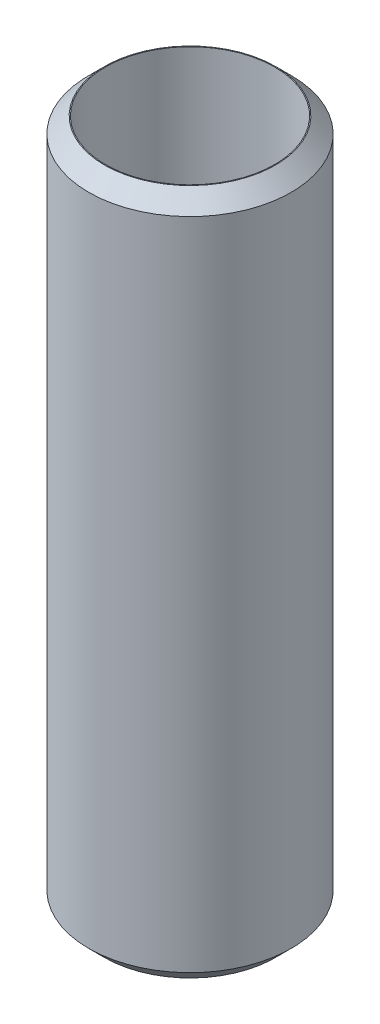
ISO-10303-21;
HEADER;
FILE_DESCRIPTION(('STEP AP214'),'2;1');
FILE_NAME('part.step','',(''),(''),'','','');
FILE_SCHEMA(('AUTOMOTIVE_DESIGN { 1 0 10303 214 1 1 1 1 }'));
ENDSEC;
DATA;
#1=APPLICATION_CONTEXT('core data for automotive mechanical design processes');
#2=APPLICATION_PROTOCOL_DEFINITION('international standard','automotive_design',2000,#1);
#3=PRODUCT_CONTEXT('',#1,'mechanical');
#4=PRODUCT('Part','Part','',(#3));
#5=PRODUCT_RELATED_PRODUCT_CATEGORY('part','',(#4));
#6=PRODUCT_DEFINITION_FORMATION('','',#4);
#7=PRODUCT_DEFINITION_CONTEXT('part definition',#1,'design');
#8=PRODUCT_DEFINITION('design','',#6,#7);
#9=PRODUCT_DEFINITION_SHAPE('','',#8);
#10=(LENGTH_UNIT() NAMED_UNIT(*) SI_UNIT(.MILLI.,.METRE.));
#11=(NAMED_UNIT(*) PLANE_ANGLE_UNIT() SI_UNIT($,.RADIAN.));
#12=(NAMED_UNIT(*) SI_UNIT($,.STERADIAN.) SOLID_ANGLE_UNIT());
#13=UNCERTAINTY_MEASURE_WITH_UNIT(LENGTH_MEASURE(1.E-05),#10,'distance_accuracy_value','');
#14=(GEOMETRIC_REPRESENTATION_CONTEXT(3) GLOBAL_UNCERTAINTY_ASSIGNED_CONTEXT((#13)) GLOBAL_UNIT_ASSIGNED_CONTEXT((#10,
#11,#12)) REPRESENTATION_CONTEXT('',''));
#15=CARTESIAN_POINT('',(0.,0.,0.));
#16=DIRECTION('',(0.,0.,1.));
#17=DIRECTION('',(1.,0.,0.));
#18=AXIS2_PLACEMENT_3D('',#15,#16,#17);
#19=CARTESIAN_POINT('',(0.,237.281671656271,0.));
#20=DIRECTION('',(0.,-1.,0.));
#21=DIRECTION('',(0.,0.,-1.));
#22=AXIS2_PLACEMENT_3D('',#19,#20,#21);
#23=CYLINDRICAL_SURFACE('',#22,35.);
#24=CARTESIAN_POINT('',(0.,231.837477696698,0.));
#25=DIRECTION('',(0.,1.,0.));
#26=DIRECTION('',(0.,0.,1.));
#27=AXIS2_PLACEMENT_3D('',#24,#25,#26);
#28=CIRCLE('',#27,35.);
#29=CARTESIAN_POINT('',(0.,231.837477696698,-35.));
#30=VERTEX_POINT('',#29);
#31=EDGE_CURVE('E50',#30,#30,#28,.F.);
#32=CARTESIAN_POINT('',(0.,5.44419395957246,0.));
#33=DIRECTION('',(0.,1.,0.));
#34=DIRECTION('',(0.,0.,1.));
#35=AXIS2_PLACEMENT_3D('',#32,#33,#34);
#36=CIRCLE('',#35,35.);
#37=CARTESIAN_POINT('',(0.,5.44419395957244,-35.));
#38=VERTEX_POINT('',#37);
#39=EDGE_CURVE('E51',#38,#38,#36,.T.);
#40=CARTESIAN_POINT('',(0.,231.837477696698,-35.));
#41=CARTESIAN_POINT('',(0.,229.479214324437,-35.));
#42=CARTESIAN_POINT('',(0.,227.120950952175,-35.));
#43=CARTESIAN_POINT('',(0.,222.404424207651,-35.));
#44=CARTESIAN_POINT('',(0.,220.04616083539,-35.));
#45=CARTESIAN_POINT('',(0.,215.329634090866,-35.));
#46=CARTESIAN_POINT('',(0.,212.971370718605,-35.));
#47=CARTESIAN_POINT('',(0.,208.254843974081,-35.));
#48=CARTESIAN_POINT('',(0.,205.896580601819,-35.));
#49=CARTESIAN_POINT('',(0.,201.180053857296,-35.));
#50=CARTESIAN_POINT('',(0.,198.821790485034,-35.));
#51=CARTESIAN_POINT('',(0.,194.105263740511,-35.));
#52=CARTESIAN_POINT('',(0.,191.747000368249,-35.));
#53=CARTESIAN_POINT('',(0.,187.030473623726,-35.));
#54=CARTESIAN_POINT('',(0.,184.672210251464,-35.));
#55=CARTESIAN_POINT('',(0.,179.95568350694,-35.));
#56=CARTESIAN_POINT('',(0.,177.597420134679,-35.));
#57=CARTESIAN_POINT('',(0.,172.880893390155,-35.));
#58=CARTESIAN_POINT('',(0.,170.522630017893,-35.));
#59=CARTESIAN_POINT('',(0.,165.80610327337,-35.));
#60=CARTESIAN_POINT('',(0.,163.447839901108,-35.));
#61=CARTESIAN_POINT('',(0.,158.731313156585,-35.));
#62=CARTESIAN_POINT('',(0.,156.373049784323,-35.));
#63=CARTESIAN_POINT('',(0.,151.6565230398,-35.));
#64=CARTESIAN_POINT('',(0.,149.298259667538,-35.));
#65=CARTESIAN_POINT('',(0.,144.581732923014,-35.));
#66=CARTESIAN_POINT('',(0.,142.223469550753,-35.));
#67=CARTESIAN_POINT('',(0.,137.506942806229,-35.));
#68=CARTESIAN_POINT('',(0.,135.148679433968,-35.));
#69=CARTESIAN_POINT('',(0.,130.432152689444,-35.));
#70=CARTESIAN_POINT('',(0.,128.073889317182,-35.));
#71=CARTESIAN_POINT('',(0.,123.357362572659,-35.));
#72=CARTESIAN_POINT('',(0.,120.999099200397,-35.));
#73=CARTESIAN_POINT('',(0.,116.282572455874,-35.));
#74=CARTESIAN_POINT('',(0.,113.924309083612,-35.));
#75=CARTESIAN_POINT('',(0.,109.207782339088,-35.));
#76=CARTESIAN_POINT('',(0.,106.849518966827,-35.));
#77=CARTESIAN_POINT('',(0.,102.132992222303,-35.));
#78=CARTESIAN_POINT('',(0.,99.7747288500416,-35.));
#79=CARTESIAN_POINT('',(0.,95.0582021055181,-35.));
#80=CARTESIAN_POINT('',(0.,92.6999387332564,-35.));
#81=CARTESIAN_POINT('',(0.,87.983411988733,-35.));
#82=CARTESIAN_POINT('',(0.,85.6251486164712,-35.));
#83=CARTESIAN_POINT('',(0.,80.9086218719478,-35.));
#84=CARTESIAN_POINT('',(0.,78.5503584996861,-35.));
#85=CARTESIAN_POINT('',(0.,73.8338317551626,-35.));
#86=CARTESIAN_POINT('',(0.,71.4755683829009,-35.));
#87=CARTESIAN_POINT('',(0.,66.7590416383774,-35.));
#88=CARTESIAN_POINT('',(0.,64.4007782661157,-35.));
#89=CARTESIAN_POINT('',(0.,59.6842515215922,-35.));
#90=CARTESIAN_POINT('',(0.,57.3259881493305,-35.));
#91=CARTESIAN_POINT('',(0.,52.609461404807,-35.));
#92=CARTESIAN_POINT('',(0.,50.2511980325453,-35.));
#93=CARTESIAN_POINT('',(0.,45.5346712880218,-35.));
#94=CARTESIAN_POINT('',(0.,43.1764079157601,-35.));
#95=CARTESIAN_POINT('',(0.,38.4598811712367,-35.));
#96=CARTESIAN_POINT('',(0.,36.1016177989749,-35.));
#97=CARTESIAN_POINT('',(0.,31.3850910544515,-35.));
#98=CARTESIAN_POINT('',(0.,29.0268276821897,-35.));
#99=CARTESIAN_POINT('',(0.,24.3103009376663,-35.));
#100=CARTESIAN_POINT('',(0.,21.9520375654045,-35.));
#101=CARTESIAN_POINT('',(0.,17.2355108208811,-35.));
#102=CARTESIAN_POINT('',(0.,14.8772474486194,-35.));
#103=CARTESIAN_POINT('',(0.,10.1607207040959,-35.));
#104=CARTESIAN_POINT('',(0.,7.80245733183416,-35.));
#105=CARTESIAN_POINT('',(0.,5.44419395957244,-35.));
#106=B_SPLINE_CURVE_WITH_KNOTS('',3,(#40,#41,#42,#43,#44,#45,#46,#47,#48,#49,#50,#51,#52,#53,
#54,#55,#56,#57,#58,#59,#60,#61,#62,#63,#64,#65,#66,#67,#68,#69,#70,#71,#72,#73,#74,#75,#76,#77,
#78,#79,#80,#81,#82,#83,#84,#85,#86,#87,#88,#89,#90,#91,#92,#93,#94,#95,#96,#97,#98,#99,#100,
#101,#102,#103,#104,#105),.UNSPECIFIED.,.F.,.F.,(4,2,2,2,2,2,2,2,2,2,2,2,2,2,2,2,2,2,2,2,2,2,2,
2,2,2,2,2,2,2,2,2,4),(0.,7.07479011678519,14.1495802335704,21.2243703503556,28.2991604671408,
35.373950583926,42.4487407007111,49.5235308174963,56.5983209342815,63.6731110510667,
70.7479011678519,77.8226912846371,84.8974814014223,91.9722715182074,99.0470616349926,
106.121851751778,113.196641868563,120.271431985348,127.346222102133,134.421012218919,
141.495802335704,148.570592452489,155.645382569274,162.720172686059,169.794962802844,
176.86975291963,183.944543036415,191.0193331532,198.094123269985,205.16891338677,
212.243703503556,219.318493620341,226.393283737126),.UNSPECIFIED.);
#107=EDGE_CURVE('BSEAM39',#30,#38,#106,.T.);
#108=ORIENTED_EDGE('',*,*,#31,.T.);
#109=ORIENTED_EDGE('',*,*,#39,.T.);
#110=ORIENTED_EDGE('',*,*,#107,.T.);
#111=ORIENTED_EDGE('',*,*,#107,.F.);
#112=EDGE_LOOP('',(#108,#110,#109,#111));
#113=FACE_BOUND('',#112,.T.);
#114=ADVANCED_FACE('F39',(#113),#23,.T.);
#115=CARTESIAN_POINT('',(0.,237.281671656271,0.));
#116=DIRECTION('',(0.,1.,0.));
#117=DIRECTION('',(0.,0.,1.));
#118=AXIS2_PLACEMENT_3D('',#115,#116,#117);
#119=PLANE('',#118);
#120=CARTESIAN_POINT('',(0.,237.281671656271,0.));
#121=DIRECTION('',(0.,1.,0.));
#122=DIRECTION('',(0.,0.,1.));
#123=AXIS2_PLACEMENT_3D('',#120,#121,#122);
#124=CIRCLE('',#123,29.5558060404278);
#125=CARTESIAN_POINT('',(0.,237.281671656271,29.5558060404278));
#126=VERTEX_POINT('',#125);
#127=EDGE_CURVE('E54',#126,#126,#124,.T.);
#128=ORIENTED_EDGE('',*,*,#127,.T.);
#129=EDGE_LOOP('',(#128));
#130=FACE_BOUND('',#129,.T.);
#131=CARTESIAN_POINT('',(0.,237.281671656271,0.));
#132=DIRECTION('',(0.,1.,0.));
#133=DIRECTION('',(0.,0.,1.));
#134=AXIS2_PLACEMENT_3D('',#131,#132,#133);
#135=CIRCLE('',#134,29.2516415656852);
#136=CARTESIAN_POINT('',(0.,237.281671656271,-29.2516415656852));
#137=VERTEX_POINT('',#136);
#138=EDGE_CURVE('E58',#137,#137,#135,.T.);
#139=ORIENTED_EDGE('',*,*,#138,.F.);
#140=EDGE_LOOP('',(#139));
#141=FACE_BOUND('',#140,.T.);
#142=ADVANCED_FACE('F69',(#130,#141),#119,.T.);
#143=CARTESIAN_POINT('',(0.,0.,0.));
#144=DIRECTION('',(0.,1.,0.));
#145=DIRECTION('',(0.,0.,1.));
#146=AXIS2_PLACEMENT_3D('',#143,#144,#145);
#147=PLANE('',#146);
#148=CARTESIAN_POINT('',(0.,0.,0.));
#149=DIRECTION('',(0.,1.,0.));
#150=DIRECTION('',(0.,0.,1.));
#151=AXIS2_PLACEMENT_3D('',#148,#149,#150);
#152=CIRCLE('',#151,29.5558060404275);
#153=CARTESIAN_POINT('',(0.,0.,29.5558060404275));
#154=VERTEX_POINT('',#153);
#155=EDGE_CURVE('E10',#154,#154,#152,.F.);
#156=ORIENTED_EDGE('',*,*,#155,.T.);
#157=EDGE_LOOP('',(#156));
#158=FACE_BOUND('',#157,.T.);
#159=CARTESIAN_POINT('',(0.,0.,0.));
#160=DIRECTION('',(0.,1.,0.));
#161=DIRECTION('',(0.,0.,1.));
#162=AXIS2_PLACEMENT_3D('',#159,#160,#161);
#163=CIRCLE('',#162,29.2516415656852);
#164=CARTESIAN_POINT('',(0.,0.,-29.2516415656852));
#165=VERTEX_POINT('',#164);
#166=EDGE_CURVE('E63',#165,#165,#163,.T.);
#167=ORIENTED_EDGE('',*,*,#166,.T.);
#168=EDGE_LOOP('',(#167));
#169=FACE_BOUND('',#168,.T.);
#170=ADVANCED_FACE('F75',(#158,#169),#147,.F.);
#171=CARTESIAN_POINT('',(0.,237.281671656271,0.));
#172=DIRECTION('',(0.,-1.,0.));
#173=DIRECTION('',(0.,0.,-1.));
#174=AXIS2_PLACEMENT_3D('',#171,#172,#173);
#175=CYLINDRICAL_SURFACE('',#174,29.2516415656852);
#176=CARTESIAN_POINT('',(0.,237.281671656271,-29.2516415656852));
#177=CARTESIAN_POINT('',(0.,234.809987576518,-29.2516415656852));
#178=CARTESIAN_POINT('',(0.,232.338303496765,-29.2516415656852));
#179=CARTESIAN_POINT('',(0.,227.394935337259,-29.2516415656852));
#180=CARTESIAN_POINT('',(0.,224.923251257507,-29.2516415656852));
#181=CARTESIAN_POINT('',(0.,219.979883098001,-29.2516415656852));
#182=CARTESIAN_POINT('',(0.,217.508199018248,-29.2516415656852));
#183=CARTESIAN_POINT('',(0.,212.564830858742,-29.2516415656852));
#184=CARTESIAN_POINT('',(0.,210.09314677899,-29.2516415656852));
#185=CARTESIAN_POINT('',(0.,205.149778619484,-29.2516415656852));
#186=CARTESIAN_POINT('',(0.,202.678094539731,-29.2516415656852));
#187=CARTESIAN_POINT('',(0.,197.734726380226,-29.2516415656852));
#188=CARTESIAN_POINT('',(0.,195.263042300473,-29.2516415656852));
#189=CARTESIAN_POINT('',(0.,190.319674140967,-29.2516415656852));
#190=CARTESIAN_POINT('',(0.,187.847990061214,-29.2516415656852));
#191=CARTESIAN_POINT('',(0.,182.904621901709,-29.2516415656852));
#192=CARTESIAN_POINT('',(0.,180.432937821956,-29.2516415656852));
#193=CARTESIAN_POINT('',(0.,175.48956966245,-29.2516415656852));
#194=CARTESIAN_POINT('',(0.,173.017885582697,-29.2516415656852));
#195=CARTESIAN_POINT('',(0.,168.074517423192,-29.2516415656852));
#196=CARTESIAN_POINT('',(0.,165.602833343439,-29.2516415656852));
#197=CARTESIAN_POINT('',(0.,160.659465183933,-29.2516415656852));
#198=CARTESIAN_POINT('',(0.,158.18778110418,-29.2516415656852));
#199=CARTESIAN_POINT('',(0.,153.244412944675,-29.2516415656852));
#200=CARTESIAN_POINT('',(0.,150.772728864922,-29.2516415656852));
#201=CARTESIAN_POINT('',(0.,145.829360705416,-29.2516415656852));
#202=CARTESIAN_POINT('',(0.,143.357676625664,-29.2516415656852));
#203=CARTESIAN_POINT('',(0.,138.414308466158,-29.2516415656852));
#204=CARTESIAN_POINT('',(0.,135.942624386405,-29.2516415656852));
#205=CARTESIAN_POINT('',(0.,130.999256226899,-29.2516415656852));
#206=CARTESIAN_POINT('',(0.,128.527572147147,-29.2516415656852));
#207=CARTESIAN_POINT('',(0.,123.584203987641,-29.2516415656852));
#208=CARTESIAN_POINT('',(0.,121.112519907888,-29.2516415656852));
#209=CARTESIAN_POINT('',(0.,116.169151748383,-29.2516415656852));
#210=CARTESIAN_POINT('',(0.,113.69746766863,-29.2516415656852));
#211=CARTESIAN_POINT('',(0.,108.754099509124,-29.2516415656852));
#212=CARTESIAN_POINT('',(0.,106.282415429371,-29.2516415656852));
#213=CARTESIAN_POINT('',(0.,101.339047269866,-29.2516415656852));
#214=CARTESIAN_POINT('',(0.,98.8673631901128,-29.2516415656852));
#215=CARTESIAN_POINT('',(0.,93.9239950306071,-29.2516415656852));
#216=CARTESIAN_POINT('',(0.,91.4523109508543,-29.2516415656852));
#217=CARTESIAN_POINT('',(0.,86.5089427913487,-29.2516415656852));
#218=CARTESIAN_POINT('',(0.,84.0372587115959,-29.2516415656852));
#219=CARTESIAN_POINT('',(0.,79.0938905520902,-29.2516415656852));
#220=CARTESIAN_POINT('',(0.,76.6222064723374,-29.2516415656852));
#221=CARTESIAN_POINT('',(0.,71.6788383128318,-29.2516415656852));
#222=CARTESIAN_POINT('',(0.,69.2071542330789,-29.2516415656852));
#223=CARTESIAN_POINT('',(0.,64.2637860735733,-29.2516415656852));
#224=CARTESIAN_POINT('',(0.,61.7921019938205,-29.2516415656852));
#225=CARTESIAN_POINT('',(0.,56.8487338343148,-29.2516415656852));
#226=CARTESIAN_POINT('',(0.,54.377049754562,-29.2516415656852));
#227=CARTESIAN_POINT('',(0.,49.4336815950564,-29.2516415656852));
#228=CARTESIAN_POINT('',(0.,46.9619975153036,-29.2516415656852));
#229=CARTESIAN_POINT('',(0.,42.0186293557979,-29.2516415656852));
#230=CARTESIAN_POINT('',(0.,39.5469452760451,-29.2516415656852));
#231=CARTESIAN_POINT('',(0.,34.6035771165395,-29.2516415656852));
#232=CARTESIAN_POINT('',(0.,32.1318930367866,-29.2516415656852));
#233=CARTESIAN_POINT('',(0.,27.188524877281,-29.2516415656852));
#234=CARTESIAN_POINT('',(0.,24.7168407975282,-29.2516415656852));
#235=CARTESIAN_POINT('',(0.,19.7734726380225,-29.2516415656852));
#236=CARTESIAN_POINT('',(0.,17.3017885582697,-29.2516415656852));
#237=CARTESIAN_POINT('',(0.,12.3584203987641,-29.2516415656852));
#238=CARTESIAN_POINT('',(0.,9.88673631901125,-29.2516415656852));
#239=CARTESIAN_POINT('',(0.,4.9433681595056,-29.2516415656852));
#240=CARTESIAN_POINT('',(0.,2.47168407975279,-29.2516415656852));
#241=CARTESIAN_POINT('',(0.,0.,-29.2516415656852));
#242=B_SPLINE_CURVE_WITH_KNOTS('',3,(#176,#177,#178,#179,#180,#181,#182,#183,#184,#185,#186,
#187,#188,#189,#190,#191,#192,#193,#194,#195,#196,#197,#198,#199,#200,#201,#202,#203,#204,#205,
#206,#207,#208,#209,#210,#211,#212,#213,#214,#215,#216,#217,#218,#219,#220,#221,#222,#223,#224,
#225,#226,#227,#228,#229,#230,#231,#232,#233,#234,#235,#236,#237,#238,#239,#240,#241),
.UNSPECIFIED.,.F.,.F.,(4,2,2,2,2,2,2,2,2,2,2,2,2,2,2,2,2,2,2,2,2,2,2,2,2,2,2,2,2,2,2,2,4),(0.,
7.41505223925848,14.8301044785169,22.2451567177754,29.6602089570339,37.0752611962923,
44.4903134355508,51.9053656748092,59.3204179140677,66.7354701533261,74.1505223925846,
81.565574631843,88.9806268711015,96.39567911036,103.810731349618,111.225783588877,
118.640835828135,126.055888067394,133.470940306652,140.885992545911,148.301044785169,
155.716097024428,163.131149263686,170.546201502945,177.961253742203,185.376305981461,
192.79135822072,200.206410459978,207.621462699237,215.036514938495,222.451567177754,
229.866619417012,237.281671656271),.UNSPECIFIED.);
#243=EDGE_CURVE('BSEAM70',#137,#165,#242,.T.);
#244=ORIENTED_EDGE('',*,*,#138,.T.);
#245=ORIENTED_EDGE('',*,*,#166,.F.);
#246=ORIENTED_EDGE('',*,*,#243,.T.);
#247=ORIENTED_EDGE('',*,*,#243,.F.);
#248=EDGE_LOOP('',(#244,#246,#245,#247));
#249=FACE_BOUND('',#248,.T.);
#250=ADVANCED_FACE('F70',(#249),#175,.F.);
#251=CARTESIAN_POINT('',(0.,237.281671656271,0.));
#252=DIRECTION('',(0.,-1.,0.));
#253=DIRECTION('',(0.,0.,-1.));
#254=AXIS2_PLACEMENT_3D('',#251,#252,#253);
#255=CONICAL_SURFACE('',#254,29.5558060404278,0.785398163397442);
#256=ORIENTED_EDGE('',*,*,#31,.F.);
#257=EDGE_LOOP('',(#256));
#258=FACE_BOUND('',#257,.T.);
#259=ORIENTED_EDGE('',*,*,#127,.F.);
#260=EDGE_LOOP('',(#259));
#261=FACE_BOUND('',#260,.T.);
#262=ADVANCED_FACE('F81',(#258,#261),#255,.T.);
#263=CARTESIAN_POINT('',(0.,5.44419395957246,0.));
#264=DIRECTION('',(0.,1.,0.));
#265=DIRECTION('',(0.,0.,1.));
#266=AXIS2_PLACEMENT_3D('',#263,#264,#265);
#267=CONICAL_SURFACE('',#266,35.,0.785398163397452);
#268=ORIENTED_EDGE('',*,*,#155,.F.);
#269=EDGE_LOOP('',(#268));
#270=FACE_BOUND('',#269,.T.);
#271=ORIENTED_EDGE('',*,*,#39,.F.);
#272=EDGE_LOOP('',(#271));
#273=FACE_BOUND('',#272,.T.);
#274=ADVANCED_FACE('F45',(#270,#273),#267,.T.);
#275=CLOSED_SHELL('',(#114,#142,#170,#250,#262,#274));
#276=MANIFOLD_SOLID_BREP('B2',#275);
#277=ADVANCED_BREP_SHAPE_REPRESENTATION('',(#18,#276),#14);
#278=SHAPE_DEFINITION_REPRESENTATION(#9,#277);
ENDSEC;
END-ISO-10303-21;
